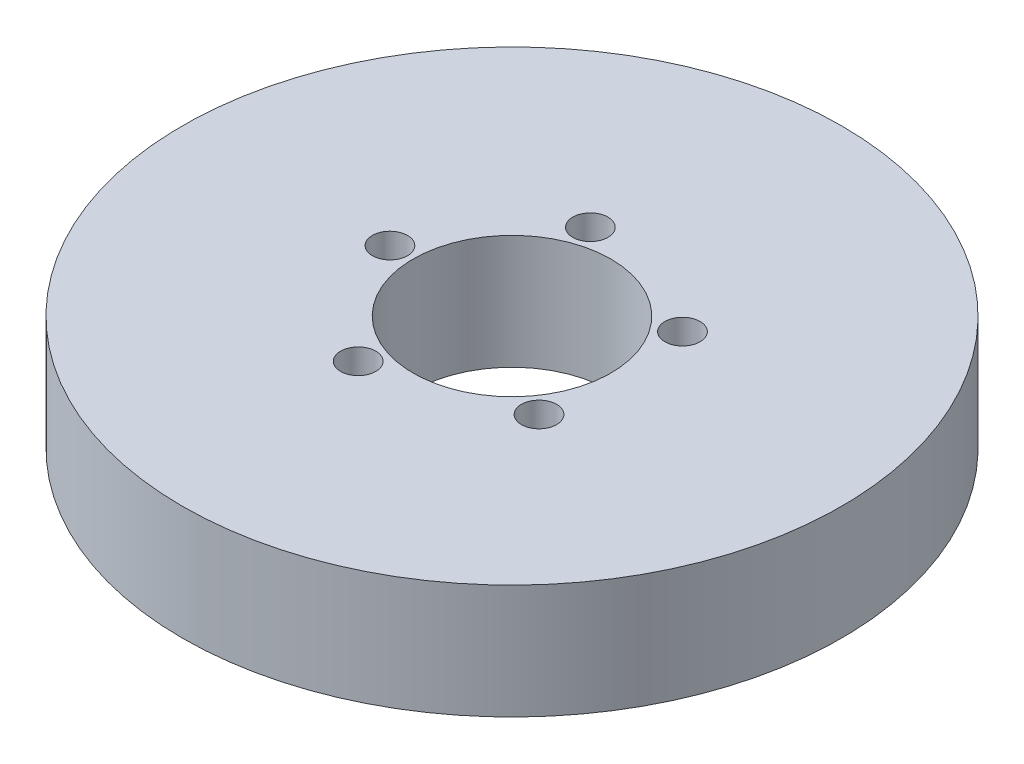
ISO-10303-21;
HEADER;
FILE_DESCRIPTION(('STEP AP214'),'2;1');
FILE_NAME('part.step','',(''),(''),'','','');
FILE_SCHEMA(('AUTOMOTIVE_DESIGN { 1 0 10303 214 1 1 1 1 }'));
ENDSEC;
DATA;
#1=APPLICATION_CONTEXT('core data for automotive mechanical design processes');
#2=APPLICATION_PROTOCOL_DEFINITION('international standard','automotive_design',2000,#1);
#3=PRODUCT_CONTEXT('',#1,'mechanical');
#4=PRODUCT('Part','Part','',(#3));
#5=PRODUCT_RELATED_PRODUCT_CATEGORY('part','',(#4));
#6=PRODUCT_DEFINITION_FORMATION('','',#4);
#7=PRODUCT_DEFINITION_CONTEXT('part definition',#1,'design');
#8=PRODUCT_DEFINITION('design','',#6,#7);
#9=PRODUCT_DEFINITION_SHAPE('','',#8);
#10=(LENGTH_UNIT() NAMED_UNIT(*) SI_UNIT(.MILLI.,.METRE.));
#11=(NAMED_UNIT(*) PLANE_ANGLE_UNIT() SI_UNIT($,.RADIAN.));
#12=(NAMED_UNIT(*) SI_UNIT($,.STERADIAN.) SOLID_ANGLE_UNIT());
#13=UNCERTAINTY_MEASURE_WITH_UNIT(LENGTH_MEASURE(1.E-05),#10,'distance_accuracy_value','');
#14=(GEOMETRIC_REPRESENTATION_CONTEXT(3) GLOBAL_UNCERTAINTY_ASSIGNED_CONTEXT((#13)) GLOBAL_UNIT_ASSIGNED_CONTEXT((#10,
#11,#12)) REPRESENTATION_CONTEXT('',''));
#15=CARTESIAN_POINT('',(0.,0.,0.));
#16=DIRECTION('',(0.,0.,1.));
#17=DIRECTION('',(1.,0.,0.));
#18=AXIS2_PLACEMENT_3D('',#15,#16,#17);
#19=CARTESIAN_POINT('',(0.,26.,0.));
#20=DIRECTION('',(0.,-1.,0.));
#21=DIRECTION('',(0.,0.,-1.));
#22=AXIS2_PLACEMENT_3D('',#19,#20,#21);
#23=CYLINDRICAL_SURFACE('',#22,75.);
#24=CARTESIAN_POINT('',(0.,26.,0.));
#25=DIRECTION('',(0.,1.,0.));
#26=DIRECTION('',(0.,0.,1.));
#27=AXIS2_PLACEMENT_3D('',#24,#25,#26);
#28=CIRCLE('',#27,75.);
#29=CARTESIAN_POINT('',(0.,26.,-75.));
#30=VERTEX_POINT('',#29);
#31=EDGE_CURVE('E10',#30,#30,#28,.T.);
#32=CARTESIAN_POINT('',(0.,0.,0.));
#33=DIRECTION('',(0.,1.,0.));
#34=DIRECTION('',(0.,0.,1.));
#35=AXIS2_PLACEMENT_3D('',#32,#33,#34);
#36=CIRCLE('',#35,75.);
#37=CARTESIAN_POINT('',(0.,0.,-75.));
#38=VERTEX_POINT('',#37);
#39=EDGE_CURVE('E37',#38,#38,#36,.T.);
#40=CARTESIAN_POINT('',(0.,26.,-75.));
#41=CARTESIAN_POINT('',(0.,25.7291666666667,-75.));
#42=CARTESIAN_POINT('',(0.,25.4583333333333,-75.));
#43=CARTESIAN_POINT('',(0.,24.9166666666667,-75.));
#44=CARTESIAN_POINT('',(0.,24.6458333333333,-75.));
#45=CARTESIAN_POINT('',(0.,24.1041666666667,-75.));
#46=CARTESIAN_POINT('',(0.,23.8333333333333,-75.));
#47=CARTESIAN_POINT('',(0.,23.2916666666667,-75.));
#48=CARTESIAN_POINT('',(0.,23.0208333333333,-75.));
#49=CARTESIAN_POINT('',(0.,22.4791666666667,-75.));
#50=CARTESIAN_POINT('',(0.,22.2083333333333,-75.));
#51=CARTESIAN_POINT('',(0.,21.6666666666667,-75.));
#52=CARTESIAN_POINT('',(0.,21.3958333333333,-75.));
#53=CARTESIAN_POINT('',(0.,20.8541666666667,-75.));
#54=CARTESIAN_POINT('',(0.,20.5833333333333,-75.));
#55=CARTESIAN_POINT('',(0.,20.0416666666667,-75.));
#56=CARTESIAN_POINT('',(0.,19.7708333333333,-75.));
#57=CARTESIAN_POINT('',(0.,19.2291666666667,-75.));
#58=CARTESIAN_POINT('',(0.,18.9583333333333,-75.));
#59=CARTESIAN_POINT('',(0.,18.4166666666667,-75.));
#60=CARTESIAN_POINT('',(0.,18.1458333333333,-75.));
#61=CARTESIAN_POINT('',(0.,17.6041666666667,-75.));
#62=CARTESIAN_POINT('',(0.,17.3333333333333,-75.));
#63=CARTESIAN_POINT('',(0.,16.7916666666667,-75.));
#64=CARTESIAN_POINT('',(0.,16.5208333333333,-75.));
#65=CARTESIAN_POINT('',(0.,15.9791666666667,-75.));
#66=CARTESIAN_POINT('',(0.,15.7083333333333,-75.));
#67=CARTESIAN_POINT('',(0.,15.1666666666667,-75.));
#68=CARTESIAN_POINT('',(0.,14.8958333333333,-75.));
#69=CARTESIAN_POINT('',(0.,14.3541666666667,-75.));
#70=CARTESIAN_POINT('',(0.,14.0833333333333,-75.));
#71=CARTESIAN_POINT('',(0.,13.5416666666667,-75.));
#72=CARTESIAN_POINT('',(0.,13.2708333333333,-75.));
#73=CARTESIAN_POINT('',(0.,12.7291666666667,-75.));
#74=CARTESIAN_POINT('',(0.,12.4583333333333,-75.));
#75=CARTESIAN_POINT('',(0.,11.9166666666667,-75.));
#76=CARTESIAN_POINT('',(0.,11.6458333333333,-75.));
#77=CARTESIAN_POINT('',(0.,11.1041666666667,-75.));
#78=CARTESIAN_POINT('',(0.,10.8333333333333,-75.));
#79=CARTESIAN_POINT('',(0.,10.2916666666667,-75.));
#80=CARTESIAN_POINT('',(0.,10.0208333333333,-75.));
#81=CARTESIAN_POINT('',(0.,9.47916666666667,-75.));
#82=CARTESIAN_POINT('',(0.,9.20833333333333,-75.));
#83=CARTESIAN_POINT('',(0.,8.66666666666667,-75.));
#84=CARTESIAN_POINT('',(0.,8.39583333333333,-75.));
#85=CARTESIAN_POINT('',(0.,7.85416666666667,-75.));
#86=CARTESIAN_POINT('',(0.,7.58333333333333,-75.));
#87=CARTESIAN_POINT('',(0.,7.04166666666667,-75.));
#88=CARTESIAN_POINT('',(0.,6.77083333333333,-75.));
#89=CARTESIAN_POINT('',(0.,6.22916666666667,-75.));
#90=CARTESIAN_POINT('',(0.,5.95833333333333,-75.));
#91=CARTESIAN_POINT('',(0.,5.41666666666667,-75.));
#92=CARTESIAN_POINT('',(0.,5.14583333333333,-75.));
#93=CARTESIAN_POINT('',(0.,4.60416666666667,-75.));
#94=CARTESIAN_POINT('',(0.,4.33333333333333,-75.));
#95=CARTESIAN_POINT('',(0.,3.79166666666667,-75.));
#96=CARTESIAN_POINT('',(0.,3.52083333333333,-75.));
#97=CARTESIAN_POINT('',(0.,2.97916666666667,-75.));
#98=CARTESIAN_POINT('',(0.,2.70833333333333,-75.));
#99=CARTESIAN_POINT('',(0.,2.16666666666667,-75.));
#100=CARTESIAN_POINT('',(0.,1.89583333333333,-75.));
#101=CARTESIAN_POINT('',(0.,1.35416666666667,-75.));
#102=CARTESIAN_POINT('',(0.,1.08333333333333,-75.));
#103=CARTESIAN_POINT('',(0.,0.541666666666667,-75.));
#104=CARTESIAN_POINT('',(0.,0.270833333333334,-75.));
#105=CARTESIAN_POINT('',(0.,0.,-75.));
#106=B_SPLINE_CURVE_WITH_KNOTS('',3,(#40,#41,#42,#43,#44,#45,#46,#47,#48,#49,#50,#51,#52,#53,
#54,#55,#56,#57,#58,#59,#60,#61,#62,#63,#64,#65,#66,#67,#68,#69,#70,#71,#72,#73,#74,#75,#76,#77,
#78,#79,#80,#81,#82,#83,#84,#85,#86,#87,#88,#89,#90,#91,#92,#93,#94,#95,#96,#97,#98,#99,#100,
#101,#102,#103,#104,#105),.UNSPECIFIED.,.F.,.F.,(4,2,2,2,2,2,2,2,2,2,2,2,2,2,2,2,2,2,2,2,2,2,2,
2,2,2,2,2,2,2,2,2,4),(0.,0.812500000000001,1.625,2.4375,3.25,4.0625,4.875,5.6875,6.5,7.3125,
8.125,8.9375,9.75,10.5625,11.375,12.1875,13.,13.8125,14.625,15.4375,16.25,17.0625,17.875,
18.6875,19.5,20.3125,21.125,21.9375,22.75,23.5625,24.375,25.1875,26.),.UNSPECIFIED.);
#107=EDGE_CURVE('BSEAM40',#30,#38,#106,.T.);
#108=ORIENTED_EDGE('',*,*,#31,.F.);
#109=ORIENTED_EDGE('',*,*,#39,.T.);
#110=ORIENTED_EDGE('',*,*,#107,.T.);
#111=ORIENTED_EDGE('',*,*,#107,.F.);
#112=EDGE_LOOP('',(#108,#110,#109,#111));
#113=FACE_BOUND('',#112,.T.);
#114=ADVANCED_FACE('F40',(#113),#23,.T.);
#115=CARTESIAN_POINT('',(0.,26.,0.));
#116=DIRECTION('',(0.,1.,0.));
#117=DIRECTION('',(0.,0.,1.));
#118=AXIS2_PLACEMENT_3D('',#115,#116,#117);
#119=PLANE('',#118);
#120=CARTESIAN_POINT('',(-8.58335389638313,26.,26.4168469806477));
#121=DIRECTION('',(0.,1.,0.));
#122=DIRECTION('',(0.951056516295155,0.,0.309016994374945));
#123=AXIS2_PLACEMENT_3D('',#120,#121,#122);
#124=CIRCLE('',#123,4.00471296662523);
#125=CARTESIAN_POINT('',(-4.77464553358251,26.,27.6543713449286));
#126=VERTEX_POINT('',#125);
#127=EDGE_CURVE('E78',#126,#126,#124,.T.);
#128=ORIENTED_EDGE('',*,*,#127,.F.);
#129=EDGE_LOOP('',(#128));
#130=FACE_BOUND('',#129,.T.);
#131=CARTESIAN_POINT('',(22.4715122382002,26.,16.3265093096452));
#132=DIRECTION('',(0.,1.,0.));
#133=DIRECTION('',(0.587785252292469,0.,-0.809016994374951));
#134=AXIS2_PLACEMENT_3D('',#131,#132,#133);
#135=CIRCLE('',#134,4.00471296662523);
#136=CARTESIAN_POINT('',(24.8254234596469,26.,13.0866284620516));
#137=VERTEX_POINT('',#136);
#138=EDGE_CURVE('E71',#137,#137,#135,.T.);
#139=ORIENTED_EDGE('',*,*,#138,.F.);
#140=EDGE_LOOP('',(#139));
#141=FACE_BOUND('',#140,.T.);
#142=CARTESIAN_POINT('',(22.4715122381999,26.,-16.3265093096455));
#143=DIRECTION('',(0.,1.,0.));
#144=DIRECTION('',(-0.58778525229248,0.,-0.809016994374942));
#145=AXIS2_PLACEMENT_3D('',#142,#143,#144);
#146=CIRCLE('',#145,4.00471296662523);
#147=CARTESIAN_POINT('',(20.1176010167531,26.,-19.566390157239));
#148=VERTEX_POINT('',#147);
#149=EDGE_CURVE('E70',#148,#148,#146,.T.);
#150=ORIENTED_EDGE('',*,*,#149,.F.);
#151=EDGE_LOOP('',(#150));
#152=FACE_BOUND('',#151,.T.);
#153=CARTESIAN_POINT('',(-8.5833538963835,26.,-26.4168469806476));
#154=DIRECTION('',(0.,1.,0.));
#155=DIRECTION('',(-0.95105651629515,0.,0.309016994374958));
#156=AXIS2_PLACEMENT_3D('',#153,#154,#155);
#157=CIRCLE('',#156,4.00471296662523);
#158=CARTESIAN_POINT('',(-12.3920622591841,26.,-25.1793226163666));
#159=VERTEX_POINT('',#158);
#160=EDGE_CURVE('E61',#159,#159,#157,.T.);
#161=ORIENTED_EDGE('',*,*,#160,.F.);
#162=EDGE_LOOP('',(#161));
#163=FACE_BOUND('',#162,.T.);
#164=CARTESIAN_POINT('',(-27.7763166836337,26.,0.));
#165=DIRECTION('',(0.,1.,0.));
#166=DIRECTION('',(0.,0.,1.));
#167=AXIS2_PLACEMENT_3D('',#164,#165,#166);
#168=CIRCLE('',#167,4.00471296662523);
#169=CARTESIAN_POINT('',(-27.7763166836337,26.,4.00471296662523));
#170=VERTEX_POINT('',#169);
#171=EDGE_CURVE('E54',#170,#170,#168,.T.);
#172=ORIENTED_EDGE('',*,*,#171,.F.);
#173=EDGE_LOOP('',(#172));
#174=FACE_BOUND('',#173,.T.);
#175=CARTESIAN_POINT('',(0.,26.,0.));
#176=DIRECTION('',(0.,1.,0.));
#177=DIRECTION('',(0.,0.,1.));
#178=AXIS2_PLACEMENT_3D('',#175,#176,#177);
#179=CIRCLE('',#178,22.5);
#180=CARTESIAN_POINT('',(0.,26.,-22.5));
#181=VERTEX_POINT('',#180);
#182=EDGE_CURVE('E50',#181,#181,#179,.T.);
#183=ORIENTED_EDGE('',*,*,#182,.F.);
#184=EDGE_LOOP('',(#183));
#185=FACE_BOUND('',#184,.T.);
#186=ORIENTED_EDGE('',*,*,#31,.T.);
#187=EDGE_LOOP('',(#186));
#188=FACE_BOUND('',#187,.T.);
#189=ADVANCED_FACE('F94',(#130,#141,#152,#163,#174,#185,#188),#119,.T.);
#190=CARTESIAN_POINT('',(0.,0.,0.));
#191=DIRECTION('',(0.,1.,0.));
#192=DIRECTION('',(0.,0.,1.));
#193=AXIS2_PLACEMENT_3D('',#190,#191,#192);
#194=PLANE('',#193);
#195=CARTESIAN_POINT('',(0.,0.,0.));
#196=DIRECTION('',(0.,1.,0.));
#197=DIRECTION('',(0.,0.,1.));
#198=AXIS2_PLACEMENT_3D('',#195,#196,#197);
#199=CIRCLE('',#198,22.5);
#200=CARTESIAN_POINT('',(0.,0.,-22.5));
#201=VERTEX_POINT('',#200);
#202=EDGE_CURVE('E47',#201,#201,#199,.T.);
#203=ORIENTED_EDGE('',*,*,#202,.T.);
#204=EDGE_LOOP('',(#203));
#205=FACE_BOUND('',#204,.T.);
#206=ORIENTED_EDGE('',*,*,#39,.F.);
#207=EDGE_LOOP('',(#206));
#208=FACE_BOUND('',#207,.T.);
#209=ADVANCED_FACE('F100',(#205,#208),#194,.F.);
#210=CARTESIAN_POINT('',(0.,26.,0.));
#211=DIRECTION('',(0.,-1.,0.));
#212=DIRECTION('',(0.,0.,-1.));
#213=AXIS2_PLACEMENT_3D('',#210,#211,#212);
#214=CYLINDRICAL_SURFACE('',#213,22.5);
#215=CARTESIAN_POINT('',(0.,26.,-22.5));
#216=CARTESIAN_POINT('',(0.,25.7291666666667,-22.5));
#217=CARTESIAN_POINT('',(0.,25.4583333333333,-22.5));
#218=CARTESIAN_POINT('',(0.,24.9166666666667,-22.5));
#219=CARTESIAN_POINT('',(0.,24.6458333333333,-22.5));
#220=CARTESIAN_POINT('',(0.,24.1041666666667,-22.5));
#221=CARTESIAN_POINT('',(0.,23.8333333333333,-22.5));
#222=CARTESIAN_POINT('',(0.,23.2916666666667,-22.5));
#223=CARTESIAN_POINT('',(0.,23.0208333333333,-22.5));
#224=CARTESIAN_POINT('',(0.,22.4791666666667,-22.5));
#225=CARTESIAN_POINT('',(0.,22.2083333333333,-22.5));
#226=CARTESIAN_POINT('',(0.,21.6666666666667,-22.5));
#227=CARTESIAN_POINT('',(0.,21.3958333333333,-22.5));
#228=CARTESIAN_POINT('',(0.,20.8541666666667,-22.5));
#229=CARTESIAN_POINT('',(0.,20.5833333333333,-22.5));
#230=CARTESIAN_POINT('',(0.,20.0416666666667,-22.5));
#231=CARTESIAN_POINT('',(0.,19.7708333333333,-22.5));
#232=CARTESIAN_POINT('',(0.,19.2291666666667,-22.5));
#233=CARTESIAN_POINT('',(0.,18.9583333333333,-22.5));
#234=CARTESIAN_POINT('',(0.,18.4166666666667,-22.5));
#235=CARTESIAN_POINT('',(0.,18.1458333333333,-22.5));
#236=CARTESIAN_POINT('',(0.,17.6041666666667,-22.5));
#237=CARTESIAN_POINT('',(0.,17.3333333333333,-22.5));
#238=CARTESIAN_POINT('',(0.,16.7916666666667,-22.5));
#239=CARTESIAN_POINT('',(0.,16.5208333333333,-22.5));
#240=CARTESIAN_POINT('',(0.,15.9791666666667,-22.5));
#241=CARTESIAN_POINT('',(0.,15.7083333333333,-22.5));
#242=CARTESIAN_POINT('',(0.,15.1666666666667,-22.5));
#243=CARTESIAN_POINT('',(0.,14.8958333333333,-22.5));
#244=CARTESIAN_POINT('',(0.,14.3541666666667,-22.5));
#245=CARTESIAN_POINT('',(0.,14.0833333333333,-22.5));
#246=CARTESIAN_POINT('',(0.,13.5416666666667,-22.5));
#247=CARTESIAN_POINT('',(0.,13.2708333333333,-22.5));
#248=CARTESIAN_POINT('',(0.,12.7291666666667,-22.5));
#249=CARTESIAN_POINT('',(0.,12.4583333333333,-22.5));
#250=CARTESIAN_POINT('',(0.,11.9166666666667,-22.5));
#251=CARTESIAN_POINT('',(0.,11.6458333333333,-22.5));
#252=CARTESIAN_POINT('',(0.,11.1041666666667,-22.5));
#253=CARTESIAN_POINT('',(0.,10.8333333333333,-22.5));
#254=CARTESIAN_POINT('',(0.,10.2916666666667,-22.5));
#255=CARTESIAN_POINT('',(0.,10.0208333333333,-22.5));
#256=CARTESIAN_POINT('',(0.,9.47916666666667,-22.5));
#257=CARTESIAN_POINT('',(0.,9.20833333333333,-22.5));
#258=CARTESIAN_POINT('',(0.,8.66666666666667,-22.5));
#259=CARTESIAN_POINT('',(0.,8.39583333333333,-22.5));
#260=CARTESIAN_POINT('',(0.,7.85416666666667,-22.5));
#261=CARTESIAN_POINT('',(0.,7.58333333333333,-22.5));
#262=CARTESIAN_POINT('',(0.,7.04166666666667,-22.5));
#263=CARTESIAN_POINT('',(0.,6.77083333333333,-22.5));
#264=CARTESIAN_POINT('',(0.,6.22916666666667,-22.5));
#265=CARTESIAN_POINT('',(0.,5.95833333333333,-22.5));
#266=CARTESIAN_POINT('',(0.,5.41666666666667,-22.5));
#267=CARTESIAN_POINT('',(0.,5.14583333333333,-22.5));
#268=CARTESIAN_POINT('',(0.,4.60416666666667,-22.5));
#269=CARTESIAN_POINT('',(0.,4.33333333333333,-22.5));
#270=CARTESIAN_POINT('',(0.,3.79166666666667,-22.5));
#271=CARTESIAN_POINT('',(0.,3.52083333333333,-22.5));
#272=CARTESIAN_POINT('',(0.,2.97916666666667,-22.5));
#273=CARTESIAN_POINT('',(0.,2.70833333333333,-22.5));
#274=CARTESIAN_POINT('',(0.,2.16666666666667,-22.5));
#275=CARTESIAN_POINT('',(0.,1.89583333333333,-22.5));
#276=CARTESIAN_POINT('',(0.,1.35416666666667,-22.5));
#277=CARTESIAN_POINT('',(0.,1.08333333333333,-22.5));
#278=CARTESIAN_POINT('',(0.,0.541666666666667,-22.5));
#279=CARTESIAN_POINT('',(0.,0.270833333333334,-22.5));
#280=CARTESIAN_POINT('',(0.,0.,-22.5));
#281=B_SPLINE_CURVE_WITH_KNOTS('',3,(#215,#216,#217,#218,#219,#220,#221,#222,#223,#224,#225,
#226,#227,#228,#229,#230,#231,#232,#233,#234,#235,#236,#237,#238,#239,#240,#241,#242,#243,#244,
#245,#246,#247,#248,#249,#250,#251,#252,#253,#254,#255,#256,#257,#258,#259,#260,#261,#262,#263,
#264,#265,#266,#267,#268,#269,#270,#271,#272,#273,#274,#275,#276,#277,#278,#279,#280),
.UNSPECIFIED.,.F.,.F.,(4,2,2,2,2,2,2,2,2,2,2,2,2,2,2,2,2,2,2,2,2,2,2,2,2,2,2,2,2,2,2,2,4),(0.,
0.812499999999997,1.625,2.4375,3.25,4.0625,4.875,5.6875,6.5,7.3125,8.125,8.93749999999999,
9.74999999999999,10.5625,11.375,12.1875,13.,13.8125,14.625,15.4375,16.25,17.0625,17.875,18.6875,
19.5,20.3125,21.125,21.9375,22.75,23.5625,24.375,25.1875,26.),.UNSPECIFIED.);
#282=EDGE_CURVE('BSEAM108',#181,#201,#281,.T.);
#283=ORIENTED_EDGE('',*,*,#182,.T.);
#284=ORIENTED_EDGE('',*,*,#202,.F.);
#285=ORIENTED_EDGE('',*,*,#282,.T.);
#286=ORIENTED_EDGE('',*,*,#282,.F.);
#287=EDGE_LOOP('',(#283,#285,#284,#286));
#288=FACE_BOUND('',#287,.T.);
#289=ADVANCED_FACE('F108',(#288),#214,.F.);
#290=CARTESIAN_POINT('',(-27.7763166836337,9.489645055913,0.));
#291=DIRECTION('',(0.,1.,0.));
#292=DIRECTION('',(0.,0.,1.));
#293=AXIS2_PLACEMENT_3D('',#290,#291,#292);
#294=CYLINDRICAL_SURFACE('',#293,4.00471296662523);
#295=CARTESIAN_POINT('',(-27.7763166836337,9.489645055913,0.));
#296=DIRECTION('',(0.,1.,0.));
#297=DIRECTION('',(0.,0.,1.));
#298=AXIS2_PLACEMENT_3D('',#295,#296,#297);
#299=CIRCLE('',#298,4.00471296662523);
#300=CARTESIAN_POINT('',(-27.7763166836337,9.489645055913,4.00471296662523));
#301=VERTEX_POINT('',#300);
#302=EDGE_CURVE('E55',#301,#301,#299,.T.);
#303=ORIENTED_EDGE('',*,*,#302,.F.);
#304=EDGE_LOOP('',(#303));
#305=FACE_BOUND('',#304,.T.);
#306=ORIENTED_EDGE('',*,*,#171,.T.);
#307=EDGE_LOOP('',(#306));
#308=FACE_BOUND('',#307,.T.);
#309=ADVANCED_FACE('F115',(#305,#308),#294,.F.);
#310=CARTESIAN_POINT('',(-27.7763166836337,9.489645055913,0.));
#311=DIRECTION('',(0.,1.,0.));
#312=DIRECTION('',(0.,0.,1.));
#313=AXIS2_PLACEMENT_3D('',#310,#311,#312);
#314=PLANE('',#313);
#315=ORIENTED_EDGE('',*,*,#302,.T.);
#316=EDGE_LOOP('',(#315));
#317=FACE_BOUND('',#316,.T.);
#318=ADVANCED_FACE('F142',(#317),#314,.T.);
#319=CARTESIAN_POINT('',(-8.5833538963835,9.489645055913,-26.4168469806476));
#320=DIRECTION('',(0.,1.,0.));
#321=DIRECTION('',(0.,0.,1.));
#322=AXIS2_PLACEMENT_3D('',#319,#320,#321);
#323=CYLINDRICAL_SURFACE('',#322,4.00471296662523);
#324=CARTESIAN_POINT('',(-8.5833538963835,9.489645055913,-26.4168469806476));
#325=DIRECTION('',(0.,1.,0.));
#326=DIRECTION('',(-0.95105651629515,0.,0.309016994374958));
#327=AXIS2_PLACEMENT_3D('',#324,#325,#326);
#328=CIRCLE('',#327,4.00471296662523);
#329=CARTESIAN_POINT('',(-12.3920622591841,9.489645055913,-25.1793226163666));
#330=VERTEX_POINT('',#329);
#331=EDGE_CURVE('E63',#330,#330,#328,.T.);
#332=ORIENTED_EDGE('',*,*,#331,.F.);
#333=EDGE_LOOP('',(#332));
#334=FACE_BOUND('',#333,.T.);
#335=ORIENTED_EDGE('',*,*,#160,.T.);
#336=EDGE_LOOP('',(#335));
#337=FACE_BOUND('',#336,.T.);
#338=ADVANCED_FACE('F147',(#334,#337),#323,.F.);
#339=CARTESIAN_POINT('',(-8.5833538963835,9.489645055913,-26.4168469806476));
#340=DIRECTION('',(0.,1.,0.));
#341=DIRECTION('',(-0.95105651629515,0.,0.309016994374958));
#342=AXIS2_PLACEMENT_3D('',#339,#340,#341);
#343=PLANE('',#342);
#344=ORIENTED_EDGE('',*,*,#331,.T.);
#345=EDGE_LOOP('',(#344));
#346=FACE_BOUND('',#345,.T.);
#347=ADVANCED_FACE('F163',(#346),#343,.T.);
#348=CARTESIAN_POINT('',(22.4715122381999,9.489645055913,-16.3265093096455));
#349=DIRECTION('',(0.,1.,0.));
#350=DIRECTION('',(0.,0.,1.));
#351=AXIS2_PLACEMENT_3D('',#348,#349,#350);
#352=CYLINDRICAL_SURFACE('',#351,4.00471296662523);
#353=CARTESIAN_POINT('',(22.4715122381999,9.489645055913,-16.3265093096455));
#354=DIRECTION('',(0.,1.,0.));
#355=DIRECTION('',(-0.58778525229248,0.,-0.809016994374942));
#356=AXIS2_PLACEMENT_3D('',#353,#354,#355);
#357=CIRCLE('',#356,4.00471296662523);
#358=CARTESIAN_POINT('',(20.1176010167531,9.489645055913,-19.566390157239));
#359=VERTEX_POINT('',#358);
#360=EDGE_CURVE('E69',#359,#359,#357,.T.);
#361=ORIENTED_EDGE('',*,*,#360,.F.);
#362=EDGE_LOOP('',(#361));
#363=FACE_BOUND('',#362,.T.);
#364=ORIENTED_EDGE('',*,*,#149,.T.);
#365=EDGE_LOOP('',(#364));
#366=FACE_BOUND('',#365,.T.);
#367=ADVANCED_FACE('F172',(#363,#366),#352,.F.);
#368=CARTESIAN_POINT('',(22.4715122381999,9.489645055913,-16.3265093096455));
#369=DIRECTION('',(0.,1.,0.));
#370=DIRECTION('',(-0.58778525229248,0.,-0.809016994374942));
#371=AXIS2_PLACEMENT_3D('',#368,#369,#370);
#372=PLANE('',#371);
#373=ORIENTED_EDGE('',*,*,#360,.T.);
#374=EDGE_LOOP('',(#373));
#375=FACE_BOUND('',#374,.T.);
#376=ADVANCED_FACE('F185',(#375),#372,.T.);
#377=CARTESIAN_POINT('',(22.4715122382002,9.489645055913,16.3265093096452));
#378=DIRECTION('',(0.,1.,0.));
#379=DIRECTION('',(0.,0.,1.));
#380=AXIS2_PLACEMENT_3D('',#377,#378,#379);
#381=CYLINDRICAL_SURFACE('',#380,4.00471296662523);
#382=CARTESIAN_POINT('',(22.4715122382002,9.489645055913,16.3265093096452));
#383=DIRECTION('',(0.,1.,0.));
#384=DIRECTION('',(0.587785252292469,0.,-0.809016994374951));
#385=AXIS2_PLACEMENT_3D('',#382,#383,#384);
#386=CIRCLE('',#385,4.00471296662523);
#387=CARTESIAN_POINT('',(24.8254234596469,9.489645055913,13.0866284620516));
#388=VERTEX_POINT('',#387);
#389=EDGE_CURVE('E76',#388,#388,#386,.T.);
#390=ORIENTED_EDGE('',*,*,#389,.F.);
#391=EDGE_LOOP('',(#390));
#392=FACE_BOUND('',#391,.T.);
#393=ORIENTED_EDGE('',*,*,#138,.T.);
#394=EDGE_LOOP('',(#393));
#395=FACE_BOUND('',#394,.T.);
#396=ADVANCED_FACE('F191',(#392,#395),#381,.F.);
#397=CARTESIAN_POINT('',(22.4715122382002,9.489645055913,16.3265093096452));
#398=DIRECTION('',(0.,1.,0.));
#399=DIRECTION('',(0.587785252292469,0.,-0.809016994374951));
#400=AXIS2_PLACEMENT_3D('',#397,#398,#399);
#401=PLANE('',#400);
#402=ORIENTED_EDGE('',*,*,#389,.T.);
#403=EDGE_LOOP('',(#402));
#404=FACE_BOUND('',#403,.T.);
#405=ADVANCED_FACE('F89',(#404),#401,.T.);
#406=CARTESIAN_POINT('',(-8.58335389638313,9.489645055913,26.4168469806477));
#407=DIRECTION('',(0.,1.,0.));
#408=DIRECTION('',(0.,0.,1.));
#409=AXIS2_PLACEMENT_3D('',#406,#407,#408);
#410=CYLINDRICAL_SURFACE('',#409,4.00471296662523);
#411=CARTESIAN_POINT('',(-8.58335389638313,9.489645055913,26.4168469806477));
#412=DIRECTION('',(0.,1.,0.));
#413=DIRECTION('',(0.951056516295155,0.,0.309016994374945));
#414=AXIS2_PLACEMENT_3D('',#411,#412,#413);
#415=CIRCLE('',#414,4.00471296662523);
#416=CARTESIAN_POINT('',(-4.77464553358251,9.489645055913,27.6543713449286));
#417=VERTEX_POINT('',#416);
#418=EDGE_CURVE('E59',#417,#417,#415,.T.);
#419=ORIENTED_EDGE('',*,*,#418,.F.);
#420=EDGE_LOOP('',(#419));
#421=FACE_BOUND('',#420,.T.);
#422=ORIENTED_EDGE('',*,*,#127,.T.);
#423=EDGE_LOOP('',(#422));
#424=FACE_BOUND('',#423,.T.);
#425=ADVANCED_FACE('F87',(#421,#424),#410,.F.);
#426=CARTESIAN_POINT('',(-8.58335389638313,9.489645055913,26.4168469806477));
#427=DIRECTION('',(0.,1.,0.));
#428=DIRECTION('',(0.951056516295155,0.,0.309016994374945));
#429=AXIS2_PLACEMENT_3D('',#426,#427,#428);
#430=PLANE('',#429);
#431=ORIENTED_EDGE('',*,*,#418,.T.);
#432=EDGE_LOOP('',(#431));
#433=FACE_BOUND('',#432,.T.);
#434=ADVANCED_FACE('F84',(#433),#430,.T.);
#435=CLOSED_SHELL('',(#114,#189,#209,#289,#309,#318,#338,#347,#367,#376,#396,#405,#425,#434));
#436=MANIFOLD_SOLID_BREP('B2',#435);
#437=ADVANCED_BREP_SHAPE_REPRESENTATION('',(#18,#436),#14);
#438=SHAPE_DEFINITION_REPRESENTATION(#9,#437);
ENDSEC;
END-ISO-10303-21;
